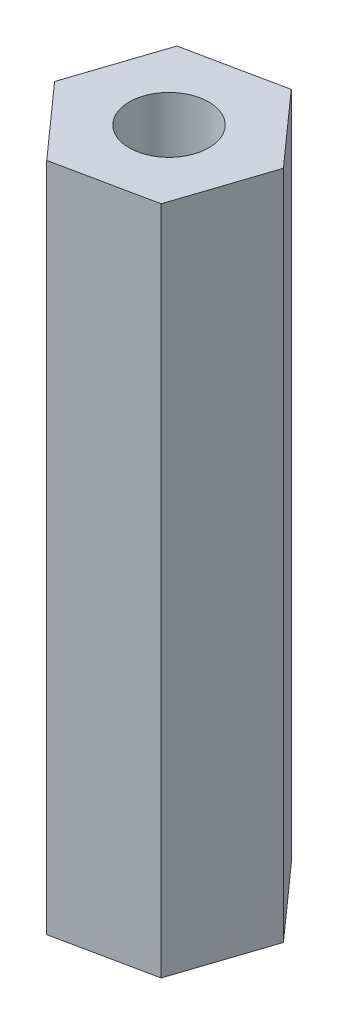
ISO-10303-21;
HEADER;
FILE_DESCRIPTION(('STEP AP214'),'2;1');
FILE_NAME('part.step','',(''),(''),'','','');
FILE_SCHEMA(('AUTOMOTIVE_DESIGN { 1 0 10303 214 1 1 1 1 }'));
ENDSEC;
DATA;
#1=APPLICATION_CONTEXT('core data for automotive mechanical design processes');
#2=APPLICATION_PROTOCOL_DEFINITION('international standard','automotive_design',2000,#1);
#3=PRODUCT_CONTEXT('',#1,'mechanical');
#4=PRODUCT('Part','Part','',(#3));
#5=PRODUCT_RELATED_PRODUCT_CATEGORY('part','',(#4));
#6=PRODUCT_DEFINITION_FORMATION('','',#4);
#7=PRODUCT_DEFINITION_CONTEXT('part definition',#1,'design');
#8=PRODUCT_DEFINITION('design','',#6,#7);
#9=PRODUCT_DEFINITION_SHAPE('','',#8);
#10=(LENGTH_UNIT() NAMED_UNIT(*) SI_UNIT(.MILLI.,.METRE.));
#11=(NAMED_UNIT(*) PLANE_ANGLE_UNIT() SI_UNIT($,.RADIAN.));
#12=(NAMED_UNIT(*) SI_UNIT($,.STERADIAN.) SOLID_ANGLE_UNIT());
#13=UNCERTAINTY_MEASURE_WITH_UNIT(LENGTH_MEASURE(1.E-05),#10,'distance_accuracy_value','');
#14=(GEOMETRIC_REPRESENTATION_CONTEXT(3) GLOBAL_UNCERTAINTY_ASSIGNED_CONTEXT((#13)) GLOBAL_UNIT_ASSIGNED_CONTEXT((#10,
#11,#12)) REPRESENTATION_CONTEXT('',''));
#15=CARTESIAN_POINT('',(0.,0.,0.));
#16=DIRECTION('',(0.,0.,1.));
#17=DIRECTION('',(1.,0.,0.));
#18=AXIS2_PLACEMENT_3D('',#15,#16,#17);
#19=CARTESIAN_POINT('',(0.,19.05,0.));
#20=DIRECTION('',(0.,1.,0.));
#21=DIRECTION('',(0.,0.,1.));
#22=AXIS2_PLACEMENT_3D('',#19,#20,#21);
#23=PLANE('',#22);
#24=DIRECTION('',(0.979184719910632,0.,-0.202971141528883));
#25=VECTOR('',#24,1.);
#26=CARTESIAN_POINT('',(-7.83249031751957,19.05,-0.674028372901006));
#27=LINE('',#26,#25);
#28=CARTESIAN_POINT('',(-7.83249031751957,19.05,-0.674028372901006));
#29=VERTEX_POINT('',#28);
#30=CARTESIAN_POINT('',(-5.14009399277207,19.05,-1.23212404613827));
#31=VERTEX_POINT('',#30);
#32=EDGE_CURVE('E135',#29,#31,#27,.T.);
#33=ORIENTED_EDGE('',*,*,#32,.T.);
#34=DIRECTION('',(0.313814195156177,0.,-0.949484413204599));
#35=VECTOR('',#34,1.);
#36=CARTESIAN_POINT('',(-5.14009399277207,19.05,-1.23212404613827));
#37=LINE('',#36,#35);
#38=CARTESIAN_POINT('',(-4.27722086116397,19.05,-3.84285549704409));
#39=VERTEX_POINT('',#38);
#40=EDGE_CURVE('E93',#31,#39,#37,.T.);
#41=ORIENTED_EDGE('',*,*,#40,.T.);
#42=DIRECTION('',(-0.665370524754455,0.,-0.746513271675716));
#43=VECTOR('',#42,1.);
#44=CARTESIAN_POINT('',(-4.27722086116397,19.05,-3.84285549704409));
#45=LINE('',#44,#43);
#46=CARTESIAN_POINT('',(-6.10674405430337,19.05,-5.89549127471265));
#47=VERTEX_POINT('',#46);
#48=EDGE_CURVE('E106',#39,#47,#45,.T.);
#49=ORIENTED_EDGE('',*,*,#48,.T.);
#50=DIRECTION('',(-0.979184719910632,0.,0.202971141528882));
#51=VECTOR('',#50,1.);
#52=CARTESIAN_POINT('',(-6.10674405430337,19.05,-5.89549127471265));
#53=LINE('',#52,#51);
#54=CARTESIAN_POINT('',(-8.79914037905087,19.05,-5.33739560147539));
#55=VERTEX_POINT('',#54);
#56=EDGE_CURVE('E100',#47,#55,#53,.T.);
#57=ORIENTED_EDGE('',*,*,#56,.T.);
#58=DIRECTION('',(-0.313814195156177,0.,0.949484413204599));
#59=VECTOR('',#58,1.);
#60=CARTESIAN_POINT('',(-8.79914037905087,19.05,-5.33739560147539));
#61=LINE('',#60,#59);
#62=CARTESIAN_POINT('',(-9.66201351065897,19.05,-2.72666415056956));
#63=VERTEX_POINT('',#62);
#64=EDGE_CURVE('E104',#55,#63,#61,.T.);
#65=ORIENTED_EDGE('',*,*,#64,.T.);
#66=DIRECTION('',(0.665370524754455,0.,0.746513271675716));
#67=VECTOR('',#66,1.);
#68=CARTESIAN_POINT('',(-9.66201351065897,19.05,-2.72666415056956));
#69=LINE('',#68,#67);
#70=EDGE_CURVE('E56',#63,#29,#69,.T.);
#71=ORIENTED_EDGE('',*,*,#70,.T.);
#72=EDGE_LOOP('',(#33,#41,#49,#57,#65,#71));
#73=FACE_BOUND('',#72,.T.);
#74=CARTESIAN_POINT('',(-6.96961718591147,19.05,-3.28475982380683));
#75=DIRECTION('',(0.,1.,0.));
#76=DIRECTION('',(0.,0.,1.));
#77=AXIS2_PLACEMENT_3D('',#74,#75,#76);
#78=CIRCLE('',#77,1.1303);
#79=CARTESIAN_POINT('',(-6.96961718591147,19.05,-2.15445982380683));
#80=VERTEX_POINT('',#79);
#81=EDGE_CURVE('E128',#80,#80,#78,.T.);
#82=ORIENTED_EDGE('',*,*,#81,.F.);
#83=EDGE_LOOP('',(#82));
#84=FACE_BOUND('',#83,.T.);
#85=ADVANCED_FACE('F39',(#73,#84),#23,.T.);
#86=CARTESIAN_POINT('',(0.,0.,0.));
#87=DIRECTION('',(0.,1.,0.));
#88=DIRECTION('',(0.,0.,1.));
#89=AXIS2_PLACEMENT_3D('',#86,#87,#88);
#90=PLANE('',#89);
#91=DIRECTION('',(0.979184719910632,0.,-0.202971141528883));
#92=VECTOR('',#91,1.);
#93=CARTESIAN_POINT('',(-7.83249031751957,0.,-0.674028372901006));
#94=LINE('',#93,#92);
#95=CARTESIAN_POINT('',(-7.83249031751957,0.,-0.674028372901006));
#96=VERTEX_POINT('',#95);
#97=CARTESIAN_POINT('',(-5.14009399277207,0.,-1.23212404613827));
#98=VERTEX_POINT('',#97);
#99=EDGE_CURVE('E124',#96,#98,#94,.T.);
#100=ORIENTED_EDGE('',*,*,#99,.F.);
#101=DIRECTION('',(0.665370524754455,0.,0.746513271675716));
#102=VECTOR('',#101,1.);
#103=CARTESIAN_POINT('',(-9.66201351065897,0.,-2.72666415056956));
#104=LINE('',#103,#102);
#105=CARTESIAN_POINT('',(-9.66201351065897,0.,-2.72666415056956));
#106=VERTEX_POINT('',#105);
#107=EDGE_CURVE('E85',#106,#96,#104,.T.);
#108=ORIENTED_EDGE('',*,*,#107,.F.);
#109=DIRECTION('',(-0.313814195156177,0.,0.949484413204599));
#110=VECTOR('',#109,1.);
#111=CARTESIAN_POINT('',(-8.79914037905087,0.,-5.33739560147539));
#112=LINE('',#111,#110);
#113=CARTESIAN_POINT('',(-8.79914037905087,0.,-5.33739560147539));
#114=VERTEX_POINT('',#113);
#115=EDGE_CURVE('E79',#114,#106,#112,.T.);
#116=ORIENTED_EDGE('',*,*,#115,.F.);
#117=DIRECTION('',(-0.979184719910632,0.,0.202971141528882));
#118=VECTOR('',#117,1.);
#119=CARTESIAN_POINT('',(-6.10674405430337,0.,-5.89549127471265));
#120=LINE('',#119,#118);
#121=CARTESIAN_POINT('',(-6.10674405430337,0.,-5.89549127471265));
#122=VERTEX_POINT('',#121);
#123=EDGE_CURVE('E114',#122,#114,#120,.T.);
#124=ORIENTED_EDGE('',*,*,#123,.F.);
#125=DIRECTION('',(-0.665370524754455,0.,-0.746513271675716));
#126=VECTOR('',#125,1.);
#127=CARTESIAN_POINT('',(-4.27722086116397,0.,-3.84285549704409));
#128=LINE('',#127,#126);
#129=CARTESIAN_POINT('',(-4.27722086116397,0.,-3.84285549704409));
#130=VERTEX_POINT('',#129);
#131=EDGE_CURVE('E130',#130,#122,#128,.T.);
#132=ORIENTED_EDGE('',*,*,#131,.F.);
#133=DIRECTION('',(0.313814195156177,0.,-0.949484413204599));
#134=VECTOR('',#133,1.);
#135=CARTESIAN_POINT('',(-5.14009399277207,0.,-1.23212404613827));
#136=LINE('',#135,#134);
#137=EDGE_CURVE('E127',#98,#130,#136,.T.);
#138=ORIENTED_EDGE('',*,*,#137,.F.);
#139=EDGE_LOOP('',(#100,#108,#116,#124,#132,#138));
#140=FACE_BOUND('',#139,.T.);
#141=CARTESIAN_POINT('',(-6.96961718591147,0.,-3.28475982380683));
#142=DIRECTION('',(0.,1.,0.));
#143=DIRECTION('',(0.,0.,1.));
#144=AXIS2_PLACEMENT_3D('',#141,#142,#143);
#145=CIRCLE('',#144,1.1303);
#146=CARTESIAN_POINT('',(-6.96961718591147,0.,-2.15445982380683));
#147=VERTEX_POINT('',#146);
#148=EDGE_CURVE('E246',#147,#147,#145,.T.);
#149=ORIENTED_EDGE('',*,*,#148,.T.);
#150=EDGE_LOOP('',(#149));
#151=FACE_BOUND('',#150,.T.);
#152=ADVANCED_FACE('F144',(#140,#151),#90,.F.);
#153=CARTESIAN_POINT('',(-7.83249031751957,19.05,-0.674028372901006));
#154=DIRECTION('',(-0.202971141528883,0.,-0.979184719910632));
#155=DIRECTION('',(-0.979184719910632,0.,0.202971141528883));
#156=AXIS2_PLACEMENT_3D('',#153,#154,#155);
#157=PLANE('',#156);
#158=ORIENTED_EDGE('',*,*,#99,.T.);
#159=DIRECTION('',(0.,-1.,0.));
#160=VECTOR('',#159,1.);
#161=CARTESIAN_POINT('',(-5.14009399277207,19.05,-1.23212404613827));
#162=LINE('',#161,#160);
#163=EDGE_CURVE('E11',#31,#98,#162,.T.);
#164=ORIENTED_EDGE('',*,*,#163,.F.);
#165=ORIENTED_EDGE('',*,*,#32,.F.);
#166=DIRECTION('',(0.,-1.,0.));
#167=VECTOR('',#166,1.);
#168=CARTESIAN_POINT('',(-7.83249031751957,19.05,-0.674028372901006));
#169=LINE('',#168,#167);
#170=EDGE_CURVE('E120',#29,#96,#169,.T.);
#171=ORIENTED_EDGE('',*,*,#170,.T.);
#172=EDGE_LOOP('',(#158,#164,#165,#171));
#173=FACE_BOUND('',#172,.T.);
#174=ADVANCED_FACE('F41',(#173),#157,.F.);
#175=CARTESIAN_POINT('',(-5.14009399277207,19.05,-1.23212404613827));
#176=DIRECTION('',(-0.949484413204599,0.,-0.313814195156177));
#177=DIRECTION('',(-0.313814195156177,0.,0.949484413204599));
#178=AXIS2_PLACEMENT_3D('',#175,#176,#177);
#179=PLANE('',#178);
#180=ORIENTED_EDGE('',*,*,#137,.T.);
#181=DIRECTION('',(0.,-1.,0.));
#182=VECTOR('',#181,1.);
#183=CARTESIAN_POINT('',(-4.27722086116397,19.05,-3.84285549704409));
#184=LINE('',#183,#182);
#185=EDGE_CURVE('E48',#39,#130,#184,.T.);
#186=ORIENTED_EDGE('',*,*,#185,.F.);
#187=ORIENTED_EDGE('',*,*,#40,.F.);
#188=ORIENTED_EDGE('',*,*,#163,.T.);
#189=EDGE_LOOP('',(#180,#186,#187,#188));
#190=FACE_BOUND('',#189,.T.);
#191=ADVANCED_FACE('F169',(#190),#179,.F.);
#192=CARTESIAN_POINT('',(-4.27722086116397,19.05,-3.84285549704409));
#193=DIRECTION('',(-0.746513271675716,0.,0.665370524754455));
#194=DIRECTION('',(0.665370524754455,0.,0.746513271675716));
#195=AXIS2_PLACEMENT_3D('',#192,#193,#194);
#196=PLANE('',#195);
#197=ORIENTED_EDGE('',*,*,#131,.T.);
#198=DIRECTION('',(0.,-1.,0.));
#199=VECTOR('',#198,1.);
#200=CARTESIAN_POINT('',(-6.10674405430337,19.05,-5.89549127471265));
#201=LINE('',#200,#199);
#202=EDGE_CURVE('E115',#47,#122,#201,.T.);
#203=ORIENTED_EDGE('',*,*,#202,.F.);
#204=ORIENTED_EDGE('',*,*,#48,.F.);
#205=ORIENTED_EDGE('',*,*,#185,.T.);
#206=EDGE_LOOP('',(#197,#203,#204,#205));
#207=FACE_BOUND('',#206,.T.);
#208=ADVANCED_FACE('F141',(#207),#196,.F.);
#209=CARTESIAN_POINT('',(-6.10674405430337,19.05,-5.89549127471265));
#210=DIRECTION('',(0.202971141528882,0.,0.979184719910632));
#211=DIRECTION('',(0.979184719910632,0.,-0.202971141528882));
#212=AXIS2_PLACEMENT_3D('',#209,#210,#211);
#213=PLANE('',#212);
#214=ORIENTED_EDGE('',*,*,#123,.T.);
#215=DIRECTION('',(0.,-1.,0.));
#216=VECTOR('',#215,1.);
#217=CARTESIAN_POINT('',(-8.79914037905087,19.05,-5.33739560147539));
#218=LINE('',#217,#216);
#219=EDGE_CURVE('E111',#55,#114,#218,.T.);
#220=ORIENTED_EDGE('',*,*,#219,.F.);
#221=ORIENTED_EDGE('',*,*,#56,.F.);
#222=ORIENTED_EDGE('',*,*,#202,.T.);
#223=EDGE_LOOP('',(#214,#220,#221,#222));
#224=FACE_BOUND('',#223,.T.);
#225=ADVANCED_FACE('F112',(#224),#213,.F.);
#226=CARTESIAN_POINT('',(-8.79914037905087,19.05,-5.33739560147539));
#227=DIRECTION('',(0.949484413204599,0.,0.313814195156177));
#228=DIRECTION('',(0.313814195156177,0.,-0.949484413204599));
#229=AXIS2_PLACEMENT_3D('',#226,#227,#228);
#230=PLANE('',#229);
#231=ORIENTED_EDGE('',*,*,#115,.T.);
#232=DIRECTION('',(0.,-1.,0.));
#233=VECTOR('',#232,1.);
#234=CARTESIAN_POINT('',(-9.66201351065897,19.05,-2.72666415056956));
#235=LINE('',#234,#233);
#236=EDGE_CURVE('E116',#63,#106,#235,.T.);
#237=ORIENTED_EDGE('',*,*,#236,.F.);
#238=ORIENTED_EDGE('',*,*,#64,.F.);
#239=ORIENTED_EDGE('',*,*,#219,.T.);
#240=EDGE_LOOP('',(#231,#237,#238,#239));
#241=FACE_BOUND('',#240,.T.);
#242=ADVANCED_FACE('F118',(#241),#230,.F.);
#243=CARTESIAN_POINT('',(-9.66201351065897,19.05,-2.72666415056956));
#244=DIRECTION('',(0.746513271675716,0.,-0.665370524754455));
#245=DIRECTION('',(-0.665370524754455,0.,-0.746513271675716));
#246=AXIS2_PLACEMENT_3D('',#243,#244,#245);
#247=PLANE('',#246);
#248=ORIENTED_EDGE('',*,*,#107,.T.);
#249=ORIENTED_EDGE('',*,*,#170,.F.);
#250=ORIENTED_EDGE('',*,*,#70,.F.);
#251=ORIENTED_EDGE('',*,*,#236,.T.);
#252=EDGE_LOOP('',(#248,#249,#250,#251));
#253=FACE_BOUND('',#252,.T.);
#254=ADVANCED_FACE('F149',(#253),#247,.F.);
#255=CARTESIAN_POINT('',(-6.96961718591147,19.05,-3.28475982380683));
#256=DIRECTION('',(0.,-1.,0.));
#257=DIRECTION('',(0.,0.,-1.));
#258=AXIS2_PLACEMENT_3D('',#255,#256,#257);
#259=CYLINDRICAL_SURFACE('',#258,1.1303);
#260=ORIENTED_EDGE('',*,*,#81,.T.);
#261=EDGE_LOOP('',(#260));
#262=FACE_BOUND('',#261,.T.);
#263=ORIENTED_EDGE('',*,*,#148,.F.);
#264=EDGE_LOOP('',(#263));
#265=FACE_BOUND('',#264,.T.);
#266=ADVANCED_FACE('F151',(#262,#265),#259,.F.);
#267=CLOSED_SHELL('',(#85,#152,#174,#191,#208,#225,#242,#254,#266));
#268=MANIFOLD_SOLID_BREP('B2',#267);
#269=ADVANCED_BREP_SHAPE_REPRESENTATION('',(#18,#268),#14);
#270=SHAPE_DEFINITION_REPRESENTATION(#9,#269);
ENDSEC;
END-ISO-10303-21;
